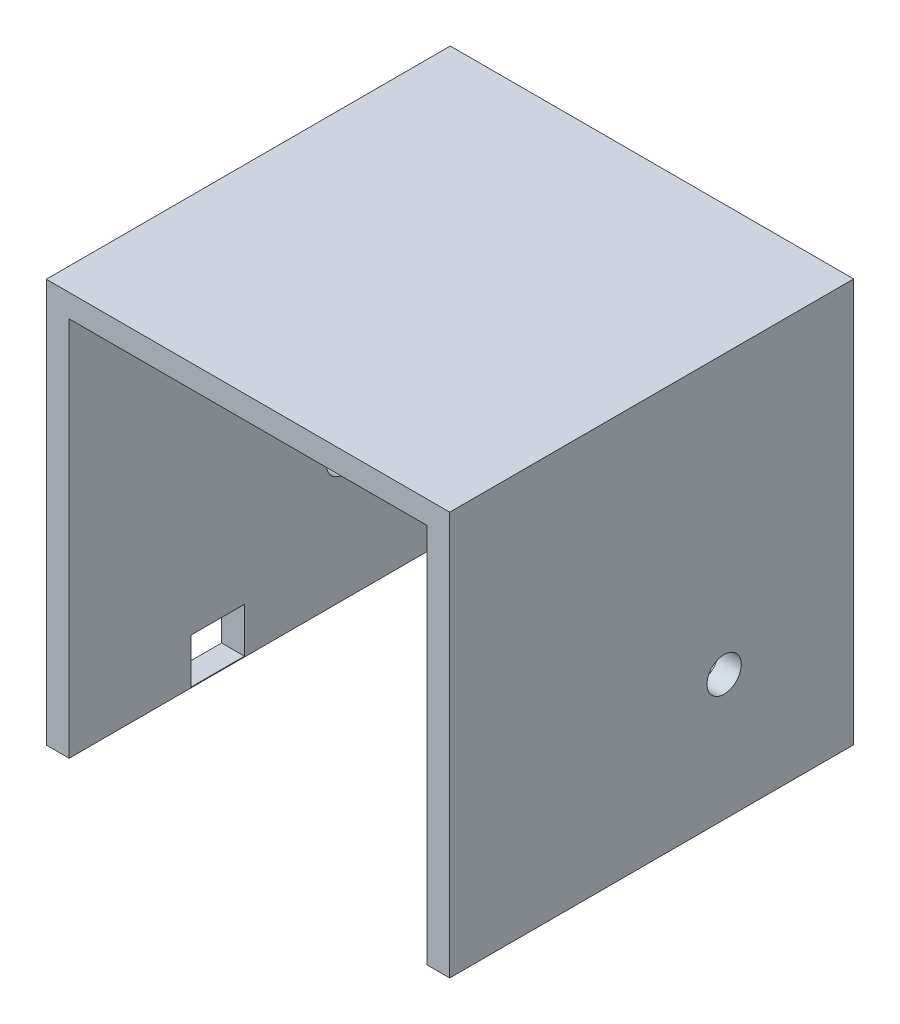
ISO-10303-21;
HEADER;
FILE_DESCRIPTION(('STEP AP214'),'2;1');
FILE_NAME('part.step','',(''),(''),'','','');
FILE_SCHEMA(('AUTOMOTIVE_DESIGN { 1 0 10303 214 1 1 1 1 }'));
ENDSEC;
DATA;
#1=APPLICATION_CONTEXT('core data for automotive mechanical design processes');
#2=APPLICATION_PROTOCOL_DEFINITION('international standard','automotive_design',2000,#1);
#3=PRODUCT_CONTEXT('',#1,'mechanical');
#4=PRODUCT('Part','Part','',(#3));
#5=PRODUCT_RELATED_PRODUCT_CATEGORY('part','',(#4));
#6=PRODUCT_DEFINITION_FORMATION('','',#4);
#7=PRODUCT_DEFINITION_CONTEXT('part definition',#1,'design');
#8=PRODUCT_DEFINITION('design','',#6,#7);
#9=PRODUCT_DEFINITION_SHAPE('','',#8);
#10=(LENGTH_UNIT() NAMED_UNIT(*) SI_UNIT(.MILLI.,.METRE.));
#11=(NAMED_UNIT(*) PLANE_ANGLE_UNIT() SI_UNIT($,.RADIAN.));
#12=(NAMED_UNIT(*) SI_UNIT($,.STERADIAN.) SOLID_ANGLE_UNIT());
#13=UNCERTAINTY_MEASURE_WITH_UNIT(LENGTH_MEASURE(1.E-05),#10,'distance_accuracy_value','');
#14=(GEOMETRIC_REPRESENTATION_CONTEXT(3) GLOBAL_UNCERTAINTY_ASSIGNED_CONTEXT((#13)) GLOBAL_UNIT_ASSIGNED_CONTEXT((#10,
#11,#12)) REPRESENTATION_CONTEXT('',''));
#15=CARTESIAN_POINT('',(0.,0.,0.));
#16=DIRECTION('',(0.,0.,1.));
#17=DIRECTION('',(1.,0.,0.));
#18=AXIS2_PLACEMENT_3D('',#15,#16,#17);
#19=CARTESIAN_POINT('',(-248.875659786192,251.919562136277,530.));
#20=DIRECTION('',(-1.,0.,0.));
#21=DIRECTION('',(0.,-1.,0.));
#22=AXIS2_PLACEMENT_3D('',#19,#20,#21);
#23=PLANE('',#22);
#24=DIRECTION('',(0.,0.,-1.));
#25=VECTOR('',#24,1.);
#26=CARTESIAN_POINT('',(-248.875659786192,-187.380437863723,530.));
#27=LINE('',#26,#25);
#28=CARTESIAN_POINT('',(-248.875659786192,-187.380437863723,370.));
#29=VERTEX_POINT('',#28);
#30=CARTESIAN_POINT('',(-248.875659786192,-187.380437863723,300.));
#31=VERTEX_POINT('',#30);
#32=EDGE_CURVE('E169',#29,#31,#27,.T.);
#33=ORIENTED_EDGE('',*,*,#32,.T.);
#34=DIRECTION('',(0.,-1.,0.));
#35=VECTOR('',#34,1.);
#36=CARTESIAN_POINT('',(-248.875659786192,251.919562136277,300.));
#37=LINE('',#36,#35);
#38=CARTESIAN_POINT('',(-248.875659786192,-246.380437863723,300.));
#39=VERTEX_POINT('',#38);
#40=EDGE_CURVE('E173',#31,#39,#37,.T.);
#41=ORIENTED_EDGE('',*,*,#40,.T.);
#42=DIRECTION('',(0.,0.,1.));
#43=VECTOR('',#42,1.);
#44=CARTESIAN_POINT('',(-248.875659786192,-246.380437863723,530.));
#45=LINE('',#44,#43);
#46=CARTESIAN_POINT('',(-248.875659786192,-246.380437863723,370.));
#47=VERTEX_POINT('',#46);
#48=EDGE_CURVE('E160',#39,#47,#45,.T.);
#49=ORIENTED_EDGE('',*,*,#48,.T.);
#50=DIRECTION('',(0.,1.,0.));
#51=VECTOR('',#50,1.);
#52=CARTESIAN_POINT('',(-248.875659786192,251.919562136277,370.));
#53=LINE('',#52,#51);
#54=EDGE_CURVE('E135',#47,#29,#53,.T.);
#55=ORIENTED_EDGE('',*,*,#54,.T.);
#56=EDGE_LOOP('',(#33,#41,#49,#55));
#57=FACE_BOUND('',#56,.T.);
#58=CARTESIAN_POINT('',(-248.875659786192,-82.3804378637225,170.));
#59=DIRECTION('',(-1.,0.,0.));
#60=DIRECTION('',(0.,-1.,0.));
#61=AXIS2_PLACEMENT_3D('',#58,#59,#60);
#62=CIRCLE('',#61,22.5);
#63=CARTESIAN_POINT('',(-248.875659786192,-104.880437863723,170.));
#64=VERTEX_POINT('',#63);
#65=EDGE_CURVE('E189',#64,#64,#62,.T.);
#66=ORIENTED_EDGE('',*,*,#65,.T.);
#67=EDGE_LOOP('',(#66));
#68=FACE_BOUND('',#67,.T.);
#69=DIRECTION('',(0.,1.,0.));
#70=VECTOR('',#69,1.);
#71=CARTESIAN_POINT('',(-248.875659786192,251.919562136277,0.));
#72=LINE('',#71,#70);
#73=CARTESIAN_POINT('',(-248.875659786192,-247.380437863723,0.));
#74=VERTEX_POINT('',#73);
#75=CARTESIAN_POINT('',(-248.875659786192,251.919562136277,0.));
#76=VERTEX_POINT('',#75);
#77=EDGE_CURVE('E193',#74,#76,#72,.T.);
#78=ORIENTED_EDGE('',*,*,#77,.T.);
#79=DIRECTION('',(0.,0.,-1.));
#80=VECTOR('',#79,1.);
#81=CARTESIAN_POINT('',(-248.875659786192,251.919562136277,530.));
#82=LINE('',#81,#80);
#83=CARTESIAN_POINT('',(-248.875659786192,251.919562136277,530.));
#84=VERTEX_POINT('',#83);
#85=EDGE_CURVE('E11',#84,#76,#82,.T.);
#86=ORIENTED_EDGE('',*,*,#85,.F.);
#87=DIRECTION('',(0.,1.,0.));
#88=VECTOR('',#87,1.);
#89=CARTESIAN_POINT('',(-248.875659786192,251.919562136277,530.));
#90=LINE('',#89,#88);
#91=CARTESIAN_POINT('',(-248.875659786192,-247.380437863723,530.));
#92=VERTEX_POINT('',#91);
#93=EDGE_CURVE('E194',#92,#84,#90,.T.);
#94=ORIENTED_EDGE('',*,*,#93,.F.);
#95=DIRECTION('',(0.,0.,-1.));
#96=VECTOR('',#95,1.);
#97=CARTESIAN_POINT('',(-248.875659786192,-247.380437863723,530.));
#98=LINE('',#97,#96);
#99=EDGE_CURVE('E220',#92,#74,#98,.T.);
#100=ORIENTED_EDGE('',*,*,#99,.T.);
#101=EDGE_LOOP('',(#78,#86,#94,#100));
#102=FACE_BOUND('',#101,.T.);
#103=ADVANCED_FACE('F40',(#57,#68,#102),#23,.F.);
#104=CARTESIAN_POINT('',(-248.875659786192,251.919562136277,530.));
#105=DIRECTION('',(0.,1.,0.));
#106=DIRECTION('',(0.,0.,1.));
#107=AXIS2_PLACEMENT_3D('',#104,#105,#106);
#108=PLANE('',#107);
#109=DIRECTION('',(1.,0.,0.));
#110=VECTOR('',#109,1.);
#111=CARTESIAN_POINT('',(-248.875659786192,251.919562136277,0.));
#112=LINE('',#111,#110);
#113=CARTESIAN_POINT('',(220.424340213808,251.919562136277,0.));
#114=VERTEX_POINT('',#113);
#115=EDGE_CURVE('E224',#76,#114,#112,.T.);
#116=ORIENTED_EDGE('',*,*,#115,.T.);
#117=DIRECTION('',(0.,0.,-1.));
#118=VECTOR('',#117,1.);
#119=CARTESIAN_POINT('',(220.424340213808,251.919562136277,530.));
#120=LINE('',#119,#118);
#121=CARTESIAN_POINT('',(220.424340213808,251.919562136277,530.));
#122=VERTEX_POINT('',#121);
#123=EDGE_CURVE('E48',#122,#114,#120,.T.);
#124=ORIENTED_EDGE('',*,*,#123,.F.);
#125=DIRECTION('',(1.,0.,0.));
#126=VECTOR('',#125,1.);
#127=CARTESIAN_POINT('',(-248.875659786192,251.919562136277,530.));
#128=LINE('',#127,#126);
#129=EDGE_CURVE('E198',#84,#122,#128,.T.);
#130=ORIENTED_EDGE('',*,*,#129,.F.);
#131=ORIENTED_EDGE('',*,*,#85,.T.);
#132=EDGE_LOOP('',(#116,#124,#130,#131));
#133=FACE_BOUND('',#132,.T.);
#134=ADVANCED_FACE('F295',(#133),#108,.F.);
#135=CARTESIAN_POINT('',(220.424340213808,251.919562136277,530.));
#136=DIRECTION('',(1.,0.,0.));
#137=DIRECTION('',(0.,1.,0.));
#138=AXIS2_PLACEMENT_3D('',#135,#136,#137);
#139=PLANE('',#138);
#140=CARTESIAN_POINT('',(220.424340213808,-82.3804378637225,170.));
#141=DIRECTION('',(1.,0.,0.));
#142=DIRECTION('',(0.,1.,0.));
#143=AXIS2_PLACEMENT_3D('',#140,#141,#142);
#144=CIRCLE('',#143,22.5);
#145=CARTESIAN_POINT('',(220.424340213808,-59.8804378637226,170.));
#146=VERTEX_POINT('',#145);
#147=EDGE_CURVE('E185',#146,#146,#144,.T.);
#148=ORIENTED_EDGE('',*,*,#147,.T.);
#149=EDGE_LOOP('',(#148));
#150=FACE_BOUND('',#149,.T.);
#151=DIRECTION('',(0.,-1.,0.));
#152=VECTOR('',#151,1.);
#153=CARTESIAN_POINT('',(220.424340213808,251.919562136277,0.));
#154=LINE('',#153,#152);
#155=CARTESIAN_POINT('',(220.424340213808,-247.380437863723,0.));
#156=VERTEX_POINT('',#155);
#157=EDGE_CURVE('E227',#114,#156,#154,.T.);
#158=ORIENTED_EDGE('',*,*,#157,.T.);
#159=DIRECTION('',(0.,0.,-1.));
#160=VECTOR('',#159,1.);
#161=CARTESIAN_POINT('',(220.424340213808,-247.380437863723,530.));
#162=LINE('',#161,#160);
#163=CARTESIAN_POINT('',(220.424340213808,-247.380437863723,530.));
#164=VERTEX_POINT('',#163);
#165=EDGE_CURVE('E263',#164,#156,#162,.T.);
#166=ORIENTED_EDGE('',*,*,#165,.F.);
#167=DIRECTION('',(0.,-1.,0.));
#168=VECTOR('',#167,1.);
#169=CARTESIAN_POINT('',(220.424340213808,251.919562136277,530.));
#170=LINE('',#169,#168);
#171=EDGE_CURVE('E202',#122,#164,#170,.T.);
#172=ORIENTED_EDGE('',*,*,#171,.F.);
#173=ORIENTED_EDGE('',*,*,#123,.T.);
#174=EDGE_LOOP('',(#158,#166,#172,#173));
#175=FACE_BOUND('',#174,.T.);
#176=ADVANCED_FACE('F272',(#150,#175),#139,.F.);
#177=CARTESIAN_POINT('',(220.424340213808,-247.380437863723,530.));
#178=DIRECTION('',(0.,1.,0.));
#179=DIRECTION('',(0.,0.,1.));
#180=AXIS2_PLACEMENT_3D('',#177,#178,#179);
#181=PLANE('',#180);
#182=DIRECTION('',(1.,0.,0.));
#183=VECTOR('',#182,1.);
#184=CARTESIAN_POINT('',(220.424340213808,-247.380437863723,0.));
#185=LINE('',#184,#183);
#186=CARTESIAN_POINT('',(250.424340213808,-247.380437863723,0.));
#187=VERTEX_POINT('',#186);
#188=EDGE_CURVE('E230',#156,#187,#185,.T.);
#189=ORIENTED_EDGE('',*,*,#188,.T.);
#190=DIRECTION('',(0.,0.,-1.));
#191=VECTOR('',#190,1.);
#192=CARTESIAN_POINT('',(250.424340213808,-247.380437863723,530.));
#193=LINE('',#192,#191);
#194=CARTESIAN_POINT('',(250.424340213808,-247.380437863723,530.));
#195=VERTEX_POINT('',#194);
#196=EDGE_CURVE('E259',#195,#187,#193,.T.);
#197=ORIENTED_EDGE('',*,*,#196,.F.);
#198=DIRECTION('',(1.,0.,0.));
#199=VECTOR('',#198,1.);
#200=CARTESIAN_POINT('',(220.424340213808,-247.380437863723,530.));
#201=LINE('',#200,#199);
#202=EDGE_CURVE('E205',#164,#195,#201,.T.);
#203=ORIENTED_EDGE('',*,*,#202,.F.);
#204=ORIENTED_EDGE('',*,*,#165,.T.);
#205=EDGE_LOOP('',(#189,#197,#203,#204));
#206=FACE_BOUND('',#205,.T.);
#207=ADVANCED_FACE('F283',(#206),#181,.F.);
#208=CARTESIAN_POINT('',(250.424340213808,-247.380437863723,530.));
#209=DIRECTION('',(-1.,0.,0.));
#210=DIRECTION('',(0.,0.,1.));
#211=AXIS2_PLACEMENT_3D('',#208,#209,#210);
#212=PLANE('',#211);
#213=CARTESIAN_POINT('',(250.424340213808,-82.3804378637225,170.));
#214=DIRECTION('',(-1.,0.,0.));
#215=DIRECTION('',(0.,0.,1.));
#216=AXIS2_PLACEMENT_3D('',#213,#214,#215);
#217=CIRCLE('',#216,22.5);
#218=CARTESIAN_POINT('',(250.424340213808,-82.3804378637225,192.5));
#219=VERTEX_POINT('',#218);
#220=EDGE_CURVE('E181',#219,#219,#217,.T.);
#221=ORIENTED_EDGE('',*,*,#220,.T.);
#222=EDGE_LOOP('',(#221));
#223=FACE_BOUND('',#222,.T.);
#224=DIRECTION('',(0.,1.,0.));
#225=VECTOR('',#224,1.);
#226=CARTESIAN_POINT('',(250.424340213808,-247.380437863723,0.));
#227=LINE('',#226,#225);
#228=CARTESIAN_POINT('',(250.424340213808,281.919562136277,0.));
#229=VERTEX_POINT('',#228);
#230=EDGE_CURVE('E233',#187,#229,#227,.T.);
#231=ORIENTED_EDGE('',*,*,#230,.T.);
#232=DIRECTION('',(0.,0.,-1.));
#233=VECTOR('',#232,1.);
#234=CARTESIAN_POINT('',(250.424340213808,281.919562136277,530.));
#235=LINE('',#234,#233);
#236=CARTESIAN_POINT('',(250.424340213808,281.919562136277,530.));
#237=VERTEX_POINT('',#236);
#238=EDGE_CURVE('E255',#237,#229,#235,.T.);
#239=ORIENTED_EDGE('',*,*,#238,.F.);
#240=DIRECTION('',(0.,1.,0.));
#241=VECTOR('',#240,1.);
#242=CARTESIAN_POINT('',(250.424340213808,-247.380437863723,530.));
#243=LINE('',#242,#241);
#244=EDGE_CURVE('E208',#195,#237,#243,.T.);
#245=ORIENTED_EDGE('',*,*,#244,.F.);
#246=ORIENTED_EDGE('',*,*,#196,.T.);
#247=EDGE_LOOP('',(#231,#239,#245,#246));
#248=FACE_BOUND('',#247,.T.);
#249=ADVANCED_FACE('F287',(#223,#248),#212,.F.);
#250=CARTESIAN_POINT('',(250.424340213808,281.919562136277,530.));
#251=DIRECTION('',(0.,-1.,0.));
#252=DIRECTION('',(1.,0.,0.));
#253=AXIS2_PLACEMENT_3D('',#250,#251,#252);
#254=PLANE('',#253);
#255=DIRECTION('',(-1.,0.,0.));
#256=VECTOR('',#255,1.);
#257=CARTESIAN_POINT('',(250.424340213808,281.919562136277,0.));
#258=LINE('',#257,#256);
#259=CARTESIAN_POINT('',(-278.875659786192,281.919562136277,0.));
#260=VERTEX_POINT('',#259);
#261=EDGE_CURVE('E236',#229,#260,#258,.T.);
#262=ORIENTED_EDGE('',*,*,#261,.T.);
#263=DIRECTION('',(0.,0.,-1.));
#264=VECTOR('',#263,1.);
#265=CARTESIAN_POINT('',(-278.875659786192,281.919562136277,530.));
#266=LINE('',#265,#264);
#267=CARTESIAN_POINT('',(-278.875659786192,281.919562136277,530.));
#268=VERTEX_POINT('',#267);
#269=EDGE_CURVE('E251',#268,#260,#266,.T.);
#270=ORIENTED_EDGE('',*,*,#269,.F.);
#271=DIRECTION('',(-1.,0.,0.));
#272=VECTOR('',#271,1.);
#273=CARTESIAN_POINT('',(250.424340213808,281.919562136277,530.));
#274=LINE('',#273,#272);
#275=EDGE_CURVE('E211',#237,#268,#274,.T.);
#276=ORIENTED_EDGE('',*,*,#275,.F.);
#277=ORIENTED_EDGE('',*,*,#238,.T.);
#278=EDGE_LOOP('',(#262,#270,#276,#277));
#279=FACE_BOUND('',#278,.T.);
#280=ADVANCED_FACE('F307',(#279),#254,.F.);
#281=CARTESIAN_POINT('',(-278.875659786192,281.919562136277,530.));
#282=DIRECTION('',(1.,0.,0.));
#283=DIRECTION('',(0.,1.,0.));
#284=AXIS2_PLACEMENT_3D('',#281,#282,#283);
#285=PLANE('',#284);
#286=DIRECTION('',(0.,0.,1.));
#287=VECTOR('',#286,1.);
#288=CARTESIAN_POINT('',(-278.875659786192,-246.380437863723,300.));
#289=LINE('',#288,#287);
#290=CARTESIAN_POINT('',(-278.875659786192,-246.380437863723,300.));
#291=VERTEX_POINT('',#290);
#292=CARTESIAN_POINT('',(-278.875659786192,-246.380437863723,370.));
#293=VERTEX_POINT('',#292);
#294=EDGE_CURVE('E142',#291,#293,#289,.T.);
#295=ORIENTED_EDGE('',*,*,#294,.F.);
#296=DIRECTION('',(0.,-1.,0.));
#297=VECTOR('',#296,1.);
#298=CARTESIAN_POINT('',(-278.875659786192,-187.380437863723,300.));
#299=LINE('',#298,#297);
#300=CARTESIAN_POINT('',(-278.875659786192,-187.380437863723,300.));
#301=VERTEX_POINT('',#300);
#302=EDGE_CURVE('E63',#301,#291,#299,.T.);
#303=ORIENTED_EDGE('',*,*,#302,.F.);
#304=DIRECTION('',(0.,0.,-1.));
#305=VECTOR('',#304,1.);
#306=CARTESIAN_POINT('',(-278.875659786192,-187.380437863723,300.));
#307=LINE('',#306,#305);
#308=CARTESIAN_POINT('',(-278.875659786192,-187.380437863723,370.));
#309=VERTEX_POINT('',#308);
#310=EDGE_CURVE('E150',#309,#301,#307,.T.);
#311=ORIENTED_EDGE('',*,*,#310,.F.);
#312=DIRECTION('',(0.,1.,0.));
#313=VECTOR('',#312,1.);
#314=CARTESIAN_POINT('',(-278.875659786192,-246.380437863723,370.));
#315=LINE('',#314,#313);
#316=EDGE_CURVE('E132',#293,#309,#315,.T.);
#317=ORIENTED_EDGE('',*,*,#316,.F.);
#318=EDGE_LOOP('',(#295,#303,#311,#317));
#319=FACE_BOUND('',#318,.T.);
#320=CARTESIAN_POINT('',(-278.875659786193,-82.3804378637225,170.));
#321=DIRECTION('',(1.,0.,0.));
#322=DIRECTION('',(0.,0.,-1.));
#323=AXIS2_PLACEMENT_3D('',#320,#321,#322);
#324=CIRCLE('',#323,22.5);
#325=CARTESIAN_POINT('',(-278.875659786193,-82.3804378637225,147.5));
#326=VERTEX_POINT('',#325);
#327=EDGE_CURVE('E177',#326,#326,#324,.T.);
#328=ORIENTED_EDGE('',*,*,#327,.T.);
#329=EDGE_LOOP('',(#328));
#330=FACE_BOUND('',#329,.T.);
#331=DIRECTION('',(0.,-1.,0.));
#332=VECTOR('',#331,1.);
#333=CARTESIAN_POINT('',(-278.875659786192,281.919562136277,0.));
#334=LINE('',#333,#332);
#335=CARTESIAN_POINT('',(-278.875659786192,-247.380437863723,0.));
#336=VERTEX_POINT('',#335);
#337=EDGE_CURVE('E239',#260,#336,#334,.T.);
#338=ORIENTED_EDGE('',*,*,#337,.T.);
#339=DIRECTION('',(0.,0.,-1.));
#340=VECTOR('',#339,1.);
#341=CARTESIAN_POINT('',(-278.875659786192,-247.380437863723,530.));
#342=LINE('',#341,#340);
#343=CARTESIAN_POINT('',(-278.875659786192,-247.380437863723,530.));
#344=VERTEX_POINT('',#343);
#345=EDGE_CURVE('E247',#344,#336,#342,.T.);
#346=ORIENTED_EDGE('',*,*,#345,.F.);
#347=DIRECTION('',(0.,-1.,0.));
#348=VECTOR('',#347,1.);
#349=CARTESIAN_POINT('',(-278.875659786192,281.919562136277,530.));
#350=LINE('',#349,#348);
#351=EDGE_CURVE('E214',#268,#344,#350,.T.);
#352=ORIENTED_EDGE('',*,*,#351,.F.);
#353=ORIENTED_EDGE('',*,*,#269,.T.);
#354=EDGE_LOOP('',(#338,#346,#352,#353));
#355=FACE_BOUND('',#354,.T.);
#356=ADVANCED_FACE('F147',(#319,#330,#355),#285,.F.);
#357=CARTESIAN_POINT('',(-248.875659786192,-247.380437863723,530.));
#358=DIRECTION('',(0.,1.,0.));
#359=DIRECTION('',(0.,0.,1.));
#360=AXIS2_PLACEMENT_3D('',#357,#358,#359);
#361=PLANE('',#360);
#362=DIRECTION('',(1.,0.,0.));
#363=VECTOR('',#362,1.);
#364=CARTESIAN_POINT('',(-248.875659786192,-247.380437863723,0.));
#365=LINE('',#364,#363);
#366=EDGE_CURVE('E199',#336,#74,#365,.T.);
#367=ORIENTED_EDGE('',*,*,#366,.T.);
#368=ORIENTED_EDGE('',*,*,#99,.F.);
#369=DIRECTION('',(1.,0.,0.));
#370=VECTOR('',#369,1.);
#371=CARTESIAN_POINT('',(-248.875659786192,-247.380437863723,530.));
#372=LINE('',#371,#370);
#373=EDGE_CURVE('E217',#344,#92,#372,.T.);
#374=ORIENTED_EDGE('',*,*,#373,.F.);
#375=ORIENTED_EDGE('',*,*,#345,.T.);
#376=EDGE_LOOP('',(#367,#368,#374,#375));
#377=FACE_BOUND('',#376,.T.);
#378=ADVANCED_FACE('F301',(#377),#361,.F.);
#379=CARTESIAN_POINT('',(0.,0.,530.));
#380=DIRECTION('',(0.,0.,-1.));
#381=DIRECTION('',(-1.,0.,0.));
#382=AXIS2_PLACEMENT_3D('',#379,#380,#381);
#383=PLANE('',#382);
#384=ORIENTED_EDGE('',*,*,#93,.T.);
#385=ORIENTED_EDGE('',*,*,#129,.T.);
#386=ORIENTED_EDGE('',*,*,#171,.T.);
#387=ORIENTED_EDGE('',*,*,#202,.T.);
#388=ORIENTED_EDGE('',*,*,#244,.T.);
#389=ORIENTED_EDGE('',*,*,#275,.T.);
#390=ORIENTED_EDGE('',*,*,#351,.T.);
#391=ORIENTED_EDGE('',*,*,#373,.T.);
#392=EDGE_LOOP('',(#384,#385,#386,#387,#388,#389,#390,#391));
#393=FACE_BOUND('',#392,.T.);
#394=ADVANCED_FACE('F291',(#393),#383,.F.);
#395=CARTESIAN_POINT('',(0.,0.,0.));
#396=DIRECTION('',(0.,0.,-1.));
#397=DIRECTION('',(-1.,0.,0.));
#398=AXIS2_PLACEMENT_3D('',#395,#396,#397);
#399=PLANE('',#398);
#400=ORIENTED_EDGE('',*,*,#77,.F.);
#401=ORIENTED_EDGE('',*,*,#366,.F.);
#402=ORIENTED_EDGE('',*,*,#337,.F.);
#403=ORIENTED_EDGE('',*,*,#261,.F.);
#404=ORIENTED_EDGE('',*,*,#230,.F.);
#405=ORIENTED_EDGE('',*,*,#188,.F.);
#406=ORIENTED_EDGE('',*,*,#157,.F.);
#407=ORIENTED_EDGE('',*,*,#115,.F.);
#408=EDGE_LOOP('',(#400,#401,#402,#403,#404,#405,#406,#407));
#409=FACE_BOUND('',#408,.T.);
#410=ADVANCED_FACE('F278',(#409),#399,.T.);
#411=CARTESIAN_POINT('',(-278.875659786193,-82.3804378637225,170.));
#412=DIRECTION('',(1.,0.,0.));
#413=DIRECTION('',(0.,0.,-1.));
#414=AXIS2_PLACEMENT_3D('',#411,#412,#413);
#415=CYLINDRICAL_SURFACE('',#414,22.5);
#416=ORIENTED_EDGE('',*,*,#327,.F.);
#417=EDGE_LOOP('',(#416));
#418=FACE_BOUND('',#417,.T.);
#419=ORIENTED_EDGE('',*,*,#65,.F.);
#420=EDGE_LOOP('',(#419));
#421=FACE_BOUND('',#420,.T.);
#422=ADVANCED_FACE('F327',(#418,#421),#415,.F.);
#423=ORIENTED_EDGE('',*,*,#220,.F.);
#424=EDGE_LOOP('',(#423));
#425=FACE_BOUND('',#424,.T.);
#426=ORIENTED_EDGE('',*,*,#147,.F.);
#427=EDGE_LOOP('',(#426));
#428=FACE_BOUND('',#427,.T.);
#429=ADVANCED_FACE('F329',(#425,#428),#415,.F.);
#430=CARTESIAN_POINT('',(-58.8756597861924,-187.380437863723,300.));
#431=DIRECTION('',(0.,0.,-1.));
#432=DIRECTION('',(-1.,0.,0.));
#433=AXIS2_PLACEMENT_3D('',#430,#431,#432);
#434=PLANE('',#433);
#435=DIRECTION('',(-1.,0.,0.));
#436=VECTOR('',#435,1.);
#437=CARTESIAN_POINT('',(-58.8756597861924,-187.380437863723,300.));
#438=LINE('',#437,#436);
#439=EDGE_CURVE('E157',#31,#301,#438,.T.);
#440=ORIENTED_EDGE('',*,*,#439,.T.);
#441=ORIENTED_EDGE('',*,*,#302,.T.);
#442=DIRECTION('',(-1.,0.,0.));
#443=VECTOR('',#442,1.);
#444=CARTESIAN_POINT('',(-58.8756597861924,-246.380437863723,300.));
#445=LINE('',#444,#443);
#446=EDGE_CURVE('E139',#39,#291,#445,.T.);
#447=ORIENTED_EDGE('',*,*,#446,.F.);
#448=ORIENTED_EDGE('',*,*,#40,.F.);
#449=EDGE_LOOP('',(#440,#441,#447,#448));
#450=FACE_BOUND('',#449,.T.);
#451=ADVANCED_FACE('F336',(#450),#434,.F.);
#452=CARTESIAN_POINT('',(-58.8756597861924,-187.380437863723,300.));
#453=DIRECTION('',(0.,1.,0.));
#454=DIRECTION('',(-1.,0.,0.));
#455=AXIS2_PLACEMENT_3D('',#452,#453,#454);
#456=PLANE('',#455);
#457=DIRECTION('',(-1.,0.,0.));
#458=VECTOR('',#457,1.);
#459=CARTESIAN_POINT('',(-58.8756597861924,-187.380437863723,370.));
#460=LINE('',#459,#458);
#461=EDGE_CURVE('E138',#29,#309,#460,.T.);
#462=ORIENTED_EDGE('',*,*,#461,.T.);
#463=ORIENTED_EDGE('',*,*,#310,.T.);
#464=ORIENTED_EDGE('',*,*,#439,.F.);
#465=ORIENTED_EDGE('',*,*,#32,.F.);
#466=EDGE_LOOP('',(#462,#463,#464,#465));
#467=FACE_BOUND('',#466,.T.);
#468=ADVANCED_FACE('F393',(#467),#456,.F.);
#469=CARTESIAN_POINT('',(-58.8756597861924,-246.380437863723,370.));
#470=DIRECTION('',(0.,0.,1.));
#471=DIRECTION('',(1.,0.,0.));
#472=AXIS2_PLACEMENT_3D('',#469,#470,#471);
#473=PLANE('',#472);
#474=DIRECTION('',(-1.,0.,0.));
#475=VECTOR('',#474,1.);
#476=CARTESIAN_POINT('',(-58.8756597861924,-246.380437863723,370.));
#477=LINE('',#476,#475);
#478=EDGE_CURVE('E55',#47,#293,#477,.T.);
#479=ORIENTED_EDGE('',*,*,#478,.T.);
#480=ORIENTED_EDGE('',*,*,#316,.T.);
#481=ORIENTED_EDGE('',*,*,#461,.F.);
#482=ORIENTED_EDGE('',*,*,#54,.F.);
#483=EDGE_LOOP('',(#479,#480,#481,#482));
#484=FACE_BOUND('',#483,.T.);
#485=ADVANCED_FACE('F129',(#484),#473,.F.);
#486=CARTESIAN_POINT('',(-58.8756597861924,-246.380437863723,300.));
#487=DIRECTION('',(0.,-1.,0.));
#488=DIRECTION('',(1.,0.,0.));
#489=AXIS2_PLACEMENT_3D('',#486,#487,#488);
#490=PLANE('',#489);
#491=ORIENTED_EDGE('',*,*,#446,.T.);
#492=ORIENTED_EDGE('',*,*,#294,.T.);
#493=ORIENTED_EDGE('',*,*,#478,.F.);
#494=ORIENTED_EDGE('',*,*,#48,.F.);
#495=EDGE_LOOP('',(#491,#492,#493,#494));
#496=FACE_BOUND('',#495,.T.);
#497=ADVANCED_FACE('F143',(#496),#490,.F.);
#498=CLOSED_SHELL('',(#103,#134,#176,#207,#249,#280,#356,#378,#394,#410,#422,#429,#451,#468,
#485,#497));
#499=MANIFOLD_SOLID_BREP('B2',#498);
#500=ADVANCED_BREP_SHAPE_REPRESENTATION('',(#18,#499),#14);
#501=SHAPE_DEFINITION_REPRESENTATION(#9,#500);
ENDSEC;
END-ISO-10303-21;
